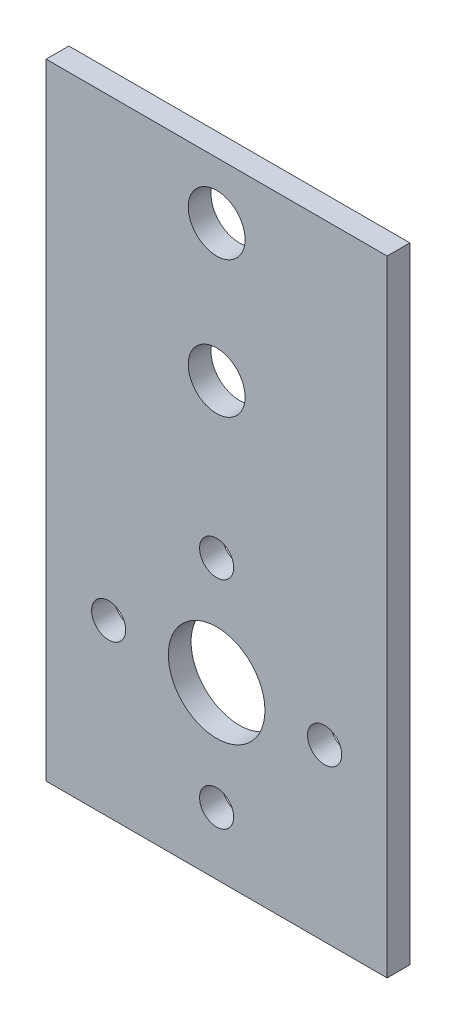
ISO-10303-21;
HEADER;
FILE_DESCRIPTION(('STEP AP214'),'2;1');
FILE_NAME('part.step','',(''),(''),'','','');
FILE_SCHEMA(('AUTOMOTIVE_DESIGN { 1 0 10303 214 1 1 1 1 }'));
ENDSEC;
DATA;
#1=APPLICATION_CONTEXT('core data for automotive mechanical design processes');
#2=APPLICATION_PROTOCOL_DEFINITION('international standard','automotive_design',2000,#1);
#3=PRODUCT_CONTEXT('',#1,'mechanical');
#4=PRODUCT('Part','Part','',(#3));
#5=PRODUCT_RELATED_PRODUCT_CATEGORY('part','',(#4));
#6=PRODUCT_DEFINITION_FORMATION('','',#4);
#7=PRODUCT_DEFINITION_CONTEXT('part definition',#1,'design');
#8=PRODUCT_DEFINITION('design','',#6,#7);
#9=PRODUCT_DEFINITION_SHAPE('','',#8);
#10=(LENGTH_UNIT() NAMED_UNIT(*) SI_UNIT(.MILLI.,.METRE.));
#11=(NAMED_UNIT(*) PLANE_ANGLE_UNIT() SI_UNIT($,.RADIAN.));
#12=(NAMED_UNIT(*) SI_UNIT($,.STERADIAN.) SOLID_ANGLE_UNIT());
#13=UNCERTAINTY_MEASURE_WITH_UNIT(LENGTH_MEASURE(1.E-05),#10,'distance_accuracy_value','');
#14=(GEOMETRIC_REPRESENTATION_CONTEXT(3) GLOBAL_UNCERTAINTY_ASSIGNED_CONTEXT((#13)) GLOBAL_UNIT_ASSIGNED_CONTEXT((#10,
#11,#12)) REPRESENTATION_CONTEXT('',''));
#15=CARTESIAN_POINT('',(0.,0.,0.));
#16=DIRECTION('',(0.,0.,1.));
#17=DIRECTION('',(1.,0.,0.));
#18=AXIS2_PLACEMENT_3D('',#15,#16,#17);
#19=CARTESIAN_POINT('',(0.,0.,2.));
#20=DIRECTION('',(0.,0.,1.));
#21=DIRECTION('',(1.,0.,0.));
#22=AXIS2_PLACEMENT_3D('',#19,#20,#21);
#23=PLANE('',#22);
#24=CARTESIAN_POINT('',(0.,23.,2.));
#25=DIRECTION('',(0.,0.,1.));
#26=DIRECTION('',(1.,0.,0.));
#27=AXIS2_PLACEMENT_3D('',#24,#25,#26);
#28=CIRCLE('',#27,2.5);
#29=CARTESIAN_POINT('',(2.5,23.,2.));
#30=VERTEX_POINT('',#29);
#31=EDGE_CURVE('E105',#30,#30,#28,.T.);
#32=ORIENTED_EDGE('',*,*,#31,.F.);
#33=EDGE_LOOP('',(#32));
#34=FACE_BOUND('',#33,.T.);
#35=CARTESIAN_POINT('',(0.,35.,2.));
#36=DIRECTION('',(0.,0.,1.));
#37=DIRECTION('',(1.,0.,0.));
#38=AXIS2_PLACEMENT_3D('',#35,#36,#37);
#39=CIRCLE('',#38,2.5);
#40=CARTESIAN_POINT('',(2.5,35.,2.));
#41=VERTEX_POINT('',#40);
#42=EDGE_CURVE('E108',#41,#41,#39,.T.);
#43=ORIENTED_EDGE('',*,*,#42,.F.);
#44=EDGE_LOOP('',(#43));
#45=FACE_BOUND('',#44,.T.);
#46=CARTESIAN_POINT('',(5.04264483799066E-13,-9.5,2.));
#47=DIRECTION('',(0.,0.,1.));
#48=DIRECTION('',(1.,0.,0.));
#49=AXIS2_PLACEMENT_3D('',#46,#47,#48);
#50=CIRCLE('',#49,1.5);
#51=CARTESIAN_POINT('',(1.5000000000005,-9.5,2.));
#52=VERTEX_POINT('',#51);
#53=EDGE_CURVE('E120',#52,#52,#50,.T.);
#54=ORIENTED_EDGE('',*,*,#53,.F.);
#55=EDGE_LOOP('',(#54));
#56=FACE_BOUND('',#55,.T.);
#57=CARTESIAN_POINT('',(0.,9.5,2.));
#58=DIRECTION('',(0.,0.,1.));
#59=DIRECTION('',(1.,0.,0.));
#60=AXIS2_PLACEMENT_3D('',#57,#58,#59);
#61=CIRCLE('',#60,1.5);
#62=CARTESIAN_POINT('',(1.49999999999999,9.5,2.));
#63=VERTEX_POINT('',#62);
#64=EDGE_CURVE('E132',#63,#63,#61,.T.);
#65=ORIENTED_EDGE('',*,*,#64,.F.);
#66=EDGE_LOOP('',(#65));
#67=FACE_BOUND('',#66,.T.);
#68=DIRECTION('',(0.,1.,0.));
#69=VECTOR('',#68,1.);
#70=CARTESIAN_POINT('',(15.,15.,2.));
#71=LINE('',#70,#69);
#72=CARTESIAN_POINT('',(15.,-15.,2.));
#73=VERTEX_POINT('',#72);
#74=CARTESIAN_POINT('',(15.,40.,2.));
#75=VERTEX_POINT('',#74);
#76=EDGE_CURVE('E71',#73,#75,#71,.T.);
#77=ORIENTED_EDGE('',*,*,#76,.T.);
#78=DIRECTION('',(1.,0.,0.));
#79=VECTOR('',#78,1.);
#80=CARTESIAN_POINT('',(-15.,40.,2.));
#81=LINE('',#80,#79);
#82=CARTESIAN_POINT('',(-15.,40.,2.));
#83=VERTEX_POINT('',#82);
#84=EDGE_CURVE('E101',#83,#75,#81,.T.);
#85=ORIENTED_EDGE('',*,*,#84,.F.);
#86=DIRECTION('',(0.,-1.,0.));
#87=VECTOR('',#86,1.);
#88=CARTESIAN_POINT('',(-15.,15.,2.));
#89=LINE('',#88,#87);
#90=CARTESIAN_POINT('',(-15.,-15.,2.));
#91=VERTEX_POINT('',#90);
#92=EDGE_CURVE('E143',#83,#91,#89,.T.);
#93=ORIENTED_EDGE('',*,*,#92,.T.);
#94=DIRECTION('',(1.,0.,0.));
#95=VECTOR('',#94,1.);
#96=CARTESIAN_POINT('',(-15.,-15.,2.));
#97=LINE('',#96,#95);
#98=EDGE_CURVE('E55',#91,#73,#97,.T.);
#99=ORIENTED_EDGE('',*,*,#98,.T.);
#100=EDGE_LOOP('',(#77,#85,#93,#99));
#101=FACE_BOUND('',#100,.T.);
#102=CARTESIAN_POINT('',(0.,0.,2.));
#103=DIRECTION('',(0.,0.,1.));
#104=DIRECTION('',(1.,0.,0.));
#105=AXIS2_PLACEMENT_3D('',#102,#103,#104);
#106=CIRCLE('',#105,4.25);
#107=CARTESIAN_POINT('',(4.24999999999999,0.,2.));
#108=VERTEX_POINT('',#107);
#109=EDGE_CURVE('E90',#108,#108,#106,.T.);
#110=ORIENTED_EDGE('',*,*,#109,.F.);
#111=EDGE_LOOP('',(#110));
#112=FACE_BOUND('',#111,.T.);
#113=CARTESIAN_POINT('',(9.50000000000025,2.54874328655439E-13,2.));
#114=DIRECTION('',(0.,0.,1.));
#115=DIRECTION('',(1.,0.,0.));
#116=AXIS2_PLACEMENT_3D('',#113,#114,#115);
#117=CIRCLE('',#116,1.5);
#118=CARTESIAN_POINT('',(11.0000000000002,2.54874328655439E-13,2.));
#119=VERTEX_POINT('',#118);
#120=EDGE_CURVE('E126',#119,#119,#117,.T.);
#121=ORIENTED_EDGE('',*,*,#120,.F.);
#122=EDGE_LOOP('',(#121));
#123=FACE_BOUND('',#122,.T.);
#124=CARTESIAN_POINT('',(-9.49999999999975,-2.56037743114629E-13,2.));
#125=DIRECTION('',(0.,0.,1.));
#126=DIRECTION('',(1.,0.,0.));
#127=AXIS2_PLACEMENT_3D('',#124,#125,#126);
#128=CIRCLE('',#127,1.5);
#129=CARTESIAN_POINT('',(-7.99999999999975,-2.56037743114629E-13,2.));
#130=VERTEX_POINT('',#129);
#131=EDGE_CURVE('E114',#130,#130,#128,.T.);
#132=ORIENTED_EDGE('',*,*,#131,.F.);
#133=EDGE_LOOP('',(#132));
#134=FACE_BOUND('',#133,.T.);
#135=ADVANCED_FACE('F38',(#34,#45,#56,#67,#101,#112,#123,#134),#23,.T.);
#136=CARTESIAN_POINT('',(0.,0.,0.));
#137=DIRECTION('',(0.,0.,1.));
#138=DIRECTION('',(1.,0.,0.));
#139=AXIS2_PLACEMENT_3D('',#136,#137,#138);
#140=PLANE('',#139);
#141=CARTESIAN_POINT('',(0.,23.,0.));
#142=DIRECTION('',(0.,0.,1.));
#143=DIRECTION('',(1.,0.,0.));
#144=AXIS2_PLACEMENT_3D('',#141,#142,#143);
#145=CIRCLE('',#144,2.5);
#146=CARTESIAN_POINT('',(2.5,23.,0.));
#147=VERTEX_POINT('',#146);
#148=EDGE_CURVE('E102',#147,#147,#145,.T.);
#149=ORIENTED_EDGE('',*,*,#148,.T.);
#150=EDGE_LOOP('',(#149));
#151=FACE_BOUND('',#150,.T.);
#152=CARTESIAN_POINT('',(0.,35.,0.));
#153=DIRECTION('',(0.,0.,1.));
#154=DIRECTION('',(1.,0.,0.));
#155=AXIS2_PLACEMENT_3D('',#152,#153,#154);
#156=CIRCLE('',#155,2.5);
#157=CARTESIAN_POINT('',(2.5,35.,0.));
#158=VERTEX_POINT('',#157);
#159=EDGE_CURVE('E310',#158,#158,#156,.T.);
#160=ORIENTED_EDGE('',*,*,#159,.T.);
#161=EDGE_LOOP('',(#160));
#162=FACE_BOUND('',#161,.T.);
#163=DIRECTION('',(0.,1.,0.));
#164=VECTOR('',#163,1.);
#165=CARTESIAN_POINT('',(15.,15.,0.));
#166=LINE('',#165,#164);
#167=CARTESIAN_POINT('',(15.,-15.,0.));
#168=VERTEX_POINT('',#167);
#169=CARTESIAN_POINT('',(15.,40.,0.));
#170=VERTEX_POINT('',#169);
#171=EDGE_CURVE('E84',#168,#170,#166,.T.);
#172=ORIENTED_EDGE('',*,*,#171,.F.);
#173=DIRECTION('',(1.,0.,0.));
#174=VECTOR('',#173,1.);
#175=CARTESIAN_POINT('',(-15.,-15.,0.));
#176=LINE('',#175,#174);
#177=CARTESIAN_POINT('',(-15.,-15.,0.));
#178=VERTEX_POINT('',#177);
#179=EDGE_CURVE('E144',#178,#168,#176,.T.);
#180=ORIENTED_EDGE('',*,*,#179,.F.);
#181=DIRECTION('',(0.,-1.,0.));
#182=VECTOR('',#181,1.);
#183=CARTESIAN_POINT('',(-15.,15.,0.));
#184=LINE('',#183,#182);
#185=CARTESIAN_POINT('',(-15.,40.,0.));
#186=VERTEX_POINT('',#185);
#187=EDGE_CURVE('E66',#186,#178,#184,.T.);
#188=ORIENTED_EDGE('',*,*,#187,.F.);
#189=DIRECTION('',(-1.,0.,0.));
#190=VECTOR('',#189,1.);
#191=CARTESIAN_POINT('',(-15.,40.,0.));
#192=LINE('',#191,#190);
#193=EDGE_CURVE('E93',#170,#186,#192,.T.);
#194=ORIENTED_EDGE('',*,*,#193,.F.);
#195=EDGE_LOOP('',(#172,#180,#188,#194));
#196=FACE_BOUND('',#195,.T.);
#197=CARTESIAN_POINT('',(0.,0.,0.));
#198=DIRECTION('',(0.,0.,1.));
#199=DIRECTION('',(1.,0.,0.));
#200=AXIS2_PLACEMENT_3D('',#197,#198,#199);
#201=CIRCLE('',#200,4.25);
#202=CARTESIAN_POINT('',(4.24999999999999,0.,0.));
#203=VERTEX_POINT('',#202);
#204=EDGE_CURVE('E135',#203,#203,#201,.T.);
#205=ORIENTED_EDGE('',*,*,#204,.T.);
#206=EDGE_LOOP('',(#205));
#207=FACE_BOUND('',#206,.T.);
#208=CARTESIAN_POINT('',(0.,9.5,0.));
#209=DIRECTION('',(0.,0.,1.));
#210=DIRECTION('',(1.,0.,0.));
#211=AXIS2_PLACEMENT_3D('',#208,#209,#210);
#212=CIRCLE('',#211,1.5);
#213=CARTESIAN_POINT('',(1.49999999999999,9.5,0.));
#214=VERTEX_POINT('',#213);
#215=EDGE_CURVE('E129',#214,#214,#212,.T.);
#216=ORIENTED_EDGE('',*,*,#215,.T.);
#217=EDGE_LOOP('',(#216));
#218=FACE_BOUND('',#217,.T.);
#219=CARTESIAN_POINT('',(9.50000000000025,2.54874328655439E-13,0.));
#220=DIRECTION('',(0.,0.,1.));
#221=DIRECTION('',(1.,0.,0.));
#222=AXIS2_PLACEMENT_3D('',#219,#220,#221);
#223=CIRCLE('',#222,1.5);
#224=CARTESIAN_POINT('',(11.0000000000002,2.54874328655439E-13,0.));
#225=VERTEX_POINT('',#224);
#226=EDGE_CURVE('E123',#225,#225,#223,.T.);
#227=ORIENTED_EDGE('',*,*,#226,.T.);
#228=EDGE_LOOP('',(#227));
#229=FACE_BOUND('',#228,.T.);
#230=CARTESIAN_POINT('',(5.04264483799066E-13,-9.5,0.));
#231=DIRECTION('',(0.,0.,1.));
#232=DIRECTION('',(1.,0.,0.));
#233=AXIS2_PLACEMENT_3D('',#230,#231,#232);
#234=CIRCLE('',#233,1.5);
#235=CARTESIAN_POINT('',(1.5000000000005,-9.5,0.));
#236=VERTEX_POINT('',#235);
#237=EDGE_CURVE('E117',#236,#236,#234,.T.);
#238=ORIENTED_EDGE('',*,*,#237,.T.);
#239=EDGE_LOOP('',(#238));
#240=FACE_BOUND('',#239,.T.);
#241=CARTESIAN_POINT('',(-9.49999999999975,-2.56037743114629E-13,0.));
#242=DIRECTION('',(0.,0.,1.));
#243=DIRECTION('',(1.,0.,0.));
#244=AXIS2_PLACEMENT_3D('',#241,#242,#243);
#245=CIRCLE('',#244,1.5);
#246=CARTESIAN_POINT('',(-7.99999999999975,-2.56037743114629E-13,0.));
#247=VERTEX_POINT('',#246);
#248=EDGE_CURVE('E113',#247,#247,#245,.T.);
#249=ORIENTED_EDGE('',*,*,#248,.T.);
#250=EDGE_LOOP('',(#249));
#251=FACE_BOUND('',#250,.T.);
#252=ADVANCED_FACE('F94',(#151,#162,#196,#207,#218,#229,#240,#251),#140,.F.);
#253=CARTESIAN_POINT('',(15.,15.,2.));
#254=DIRECTION('',(-1.,0.,0.));
#255=DIRECTION('',(0.,-1.,0.));
#256=AXIS2_PLACEMENT_3D('',#253,#254,#255);
#257=PLANE('',#256);
#258=ORIENTED_EDGE('',*,*,#171,.T.);
#259=DIRECTION('',(0.,0.,-1.));
#260=VECTOR('',#259,1.);
#261=CARTESIAN_POINT('',(15.,40.,2.));
#262=LINE('',#261,#260);
#263=EDGE_CURVE('E87',#75,#170,#262,.T.);
#264=ORIENTED_EDGE('',*,*,#263,.F.);
#265=ORIENTED_EDGE('',*,*,#76,.F.);
#266=DIRECTION('',(0.,0.,-1.));
#267=VECTOR('',#266,1.);
#268=CARTESIAN_POINT('',(15.,-15.,2.));
#269=LINE('',#268,#267);
#270=EDGE_CURVE('E47',#73,#168,#269,.T.);
#271=ORIENTED_EDGE('',*,*,#270,.T.);
#272=EDGE_LOOP('',(#258,#264,#265,#271));
#273=FACE_BOUND('',#272,.T.);
#274=ADVANCED_FACE('F40',(#273),#257,.F.);
#275=CARTESIAN_POINT('',(-15.,15.,2.));
#276=DIRECTION('',(1.,0.,0.));
#277=DIRECTION('',(0.,1.,0.));
#278=AXIS2_PLACEMENT_3D('',#275,#276,#277);
#279=PLANE('',#278);
#280=ORIENTED_EDGE('',*,*,#187,.T.);
#281=DIRECTION('',(0.,0.,-1.));
#282=VECTOR('',#281,1.);
#283=CARTESIAN_POINT('',(-15.,-15.,2.));
#284=LINE('',#283,#282);
#285=EDGE_CURVE('E11',#91,#178,#284,.T.);
#286=ORIENTED_EDGE('',*,*,#285,.F.);
#287=ORIENTED_EDGE('',*,*,#92,.F.);
#288=DIRECTION('',(0.,0.,1.));
#289=VECTOR('',#288,1.);
#290=CARTESIAN_POINT('',(-15.,40.,2.));
#291=LINE('',#290,#289);
#292=EDGE_CURVE('E98',#186,#83,#291,.T.);
#293=ORIENTED_EDGE('',*,*,#292,.F.);
#294=EDGE_LOOP('',(#280,#286,#287,#293));
#295=FACE_BOUND('',#294,.T.);
#296=ADVANCED_FACE('F150',(#295),#279,.F.);
#297=CARTESIAN_POINT('',(-15.,-15.,2.));
#298=DIRECTION('',(0.,1.,0.));
#299=DIRECTION('',(0.,0.,1.));
#300=AXIS2_PLACEMENT_3D('',#297,#298,#299);
#301=PLANE('',#300);
#302=ORIENTED_EDGE('',*,*,#179,.T.);
#303=ORIENTED_EDGE('',*,*,#270,.F.);
#304=ORIENTED_EDGE('',*,*,#98,.F.);
#305=ORIENTED_EDGE('',*,*,#285,.T.);
#306=EDGE_LOOP('',(#302,#303,#304,#305));
#307=FACE_BOUND('',#306,.T.);
#308=ADVANCED_FACE('F149',(#307),#301,.F.);
#309=CARTESIAN_POINT('',(0.,0.,2.));
#310=DIRECTION('',(0.,0.,-1.));
#311=DIRECTION('',(-1.,0.,0.));
#312=AXIS2_PLACEMENT_3D('',#309,#310,#311);
#313=CYLINDRICAL_SURFACE('',#312,4.25);
#314=ORIENTED_EDGE('',*,*,#109,.T.);
#315=EDGE_LOOP('',(#314));
#316=FACE_BOUND('',#315,.T.);
#317=ORIENTED_EDGE('',*,*,#204,.F.);
#318=EDGE_LOOP('',(#317));
#319=FACE_BOUND('',#318,.T.);
#320=ADVANCED_FACE('F178',(#316,#319),#313,.F.);
#321=CARTESIAN_POINT('',(0.,9.5,2.));
#322=DIRECTION('',(0.,0.,-1.));
#323=DIRECTION('',(-1.,0.,0.));
#324=AXIS2_PLACEMENT_3D('',#321,#322,#323);
#325=CYLINDRICAL_SURFACE('',#324,1.5);
#326=ORIENTED_EDGE('',*,*,#64,.T.);
#327=EDGE_LOOP('',(#326));
#328=FACE_BOUND('',#327,.T.);
#329=ORIENTED_EDGE('',*,*,#215,.F.);
#330=EDGE_LOOP('',(#329));
#331=FACE_BOUND('',#330,.T.);
#332=ADVANCED_FACE('F262',(#328,#331),#325,.F.);
#333=CARTESIAN_POINT('',(9.50000000000025,2.54874328655439E-13,2.));
#334=DIRECTION('',(0.,0.,-1.));
#335=DIRECTION('',(-1.,0.,0.));
#336=AXIS2_PLACEMENT_3D('',#333,#334,#335);
#337=CYLINDRICAL_SURFACE('',#336,1.5);
#338=ORIENTED_EDGE('',*,*,#120,.T.);
#339=EDGE_LOOP('',(#338));
#340=FACE_BOUND('',#339,.T.);
#341=ORIENTED_EDGE('',*,*,#226,.F.);
#342=EDGE_LOOP('',(#341));
#343=FACE_BOUND('',#342,.T.);
#344=ADVANCED_FACE('F253',(#340,#343),#337,.F.);
#345=CARTESIAN_POINT('',(5.04264483799066E-13,-9.5,2.));
#346=DIRECTION('',(0.,0.,-1.));
#347=DIRECTION('',(-1.,0.,0.));
#348=AXIS2_PLACEMENT_3D('',#345,#346,#347);
#349=CYLINDRICAL_SURFACE('',#348,1.5);
#350=ORIENTED_EDGE('',*,*,#53,.T.);
#351=EDGE_LOOP('',(#350));
#352=FACE_BOUND('',#351,.T.);
#353=ORIENTED_EDGE('',*,*,#237,.F.);
#354=EDGE_LOOP('',(#353));
#355=FACE_BOUND('',#354,.T.);
#356=ADVANCED_FACE('F164',(#352,#355),#349,.F.);
#357=CARTESIAN_POINT('',(-9.49999999999975,-2.56037743114629E-13,2.));
#358=DIRECTION('',(0.,0.,-1.));
#359=DIRECTION('',(-1.,0.,0.));
#360=AXIS2_PLACEMENT_3D('',#357,#358,#359);
#361=CYLINDRICAL_SURFACE('',#360,1.5);
#362=ORIENTED_EDGE('',*,*,#131,.T.);
#363=EDGE_LOOP('',(#362));
#364=FACE_BOUND('',#363,.T.);
#365=ORIENTED_EDGE('',*,*,#248,.F.);
#366=EDGE_LOOP('',(#365));
#367=FACE_BOUND('',#366,.T.);
#368=ADVANCED_FACE('F161',(#364,#367),#361,.F.);
#369=CARTESIAN_POINT('',(0.,40.,0.));
#370=DIRECTION('',(0.,-1.,0.));
#371=DIRECTION('',(0.,0.,-1.));
#372=AXIS2_PLACEMENT_3D('',#369,#370,#371);
#373=PLANE('',#372);
#374=ORIENTED_EDGE('',*,*,#263,.T.);
#375=ORIENTED_EDGE('',*,*,#193,.T.);
#376=ORIENTED_EDGE('',*,*,#292,.T.);
#377=ORIENTED_EDGE('',*,*,#84,.T.);
#378=EDGE_LOOP('',(#374,#375,#376,#377));
#379=FACE_BOUND('',#378,.T.);
#380=ADVANCED_FACE('F100',(#379),#373,.F.);
#381=CARTESIAN_POINT('',(0.,35.,0.));
#382=DIRECTION('',(0.,0.,1.));
#383=DIRECTION('',(1.,0.,0.));
#384=AXIS2_PLACEMENT_3D('',#381,#382,#383);
#385=CYLINDRICAL_SURFACE('',#384,2.5);
#386=ORIENTED_EDGE('',*,*,#159,.F.);
#387=EDGE_LOOP('',(#386));
#388=FACE_BOUND('',#387,.T.);
#389=ORIENTED_EDGE('',*,*,#42,.T.);
#390=EDGE_LOOP('',(#389));
#391=FACE_BOUND('',#390,.T.);
#392=ADVANCED_FACE('F190',(#388,#391),#385,.F.);
#393=CARTESIAN_POINT('',(0.,23.,0.));
#394=DIRECTION('',(0.,0.,1.));
#395=DIRECTION('',(1.,0.,0.));
#396=AXIS2_PLACEMENT_3D('',#393,#394,#395);
#397=CYLINDRICAL_SURFACE('',#396,2.5);
#398=ORIENTED_EDGE('',*,*,#148,.F.);
#399=EDGE_LOOP('',(#398));
#400=FACE_BOUND('',#399,.T.);
#401=ORIENTED_EDGE('',*,*,#31,.T.);
#402=EDGE_LOOP('',(#401));
#403=FACE_BOUND('',#402,.T.);
#404=ADVANCED_FACE('F198',(#400,#403),#397,.F.);
#405=CLOSED_SHELL('',(#135,#252,#274,#296,#308,#320,#332,#344,#356,#368,#380,#392,#404));
#406=MANIFOLD_SOLID_BREP('B2',#405);
#407=ADVANCED_BREP_SHAPE_REPRESENTATION('',(#18,#406),#14);
#408=SHAPE_DEFINITION_REPRESENTATION(#9,#407);
ENDSEC;
END-ISO-10303-21;
